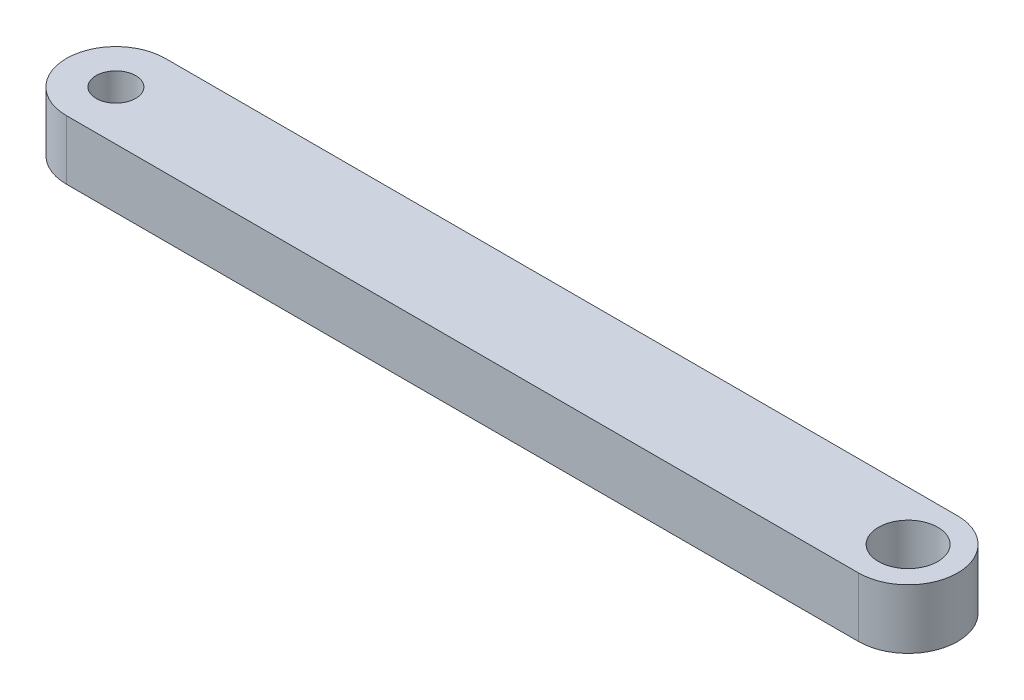
ISO-10303-21;
HEADER;
FILE_DESCRIPTION(('STEP AP214'),'2;1');
FILE_NAME('part.step','',(''),(''),'','','');
FILE_SCHEMA(('AUTOMOTIVE_DESIGN { 1 0 10303 214 1 1 1 1 }'));
ENDSEC;
DATA;
#1=APPLICATION_CONTEXT('core data for automotive mechanical design processes');
#2=APPLICATION_PROTOCOL_DEFINITION('international standard','automotive_design',2000,#1);
#3=PRODUCT_CONTEXT('',#1,'mechanical');
#4=PRODUCT('Part','Part','',(#3));
#5=PRODUCT_RELATED_PRODUCT_CATEGORY('part','',(#4));
#6=PRODUCT_DEFINITION_FORMATION('','',#4);
#7=PRODUCT_DEFINITION_CONTEXT('part definition',#1,'design');
#8=PRODUCT_DEFINITION('design','',#6,#7);
#9=PRODUCT_DEFINITION_SHAPE('','',#8);
#10=(LENGTH_UNIT() NAMED_UNIT(*) SI_UNIT(.MILLI.,.METRE.));
#11=(NAMED_UNIT(*) PLANE_ANGLE_UNIT() SI_UNIT($,.RADIAN.));
#12=(NAMED_UNIT(*) SI_UNIT($,.STERADIAN.) SOLID_ANGLE_UNIT());
#13=UNCERTAINTY_MEASURE_WITH_UNIT(LENGTH_MEASURE(1.E-05),#10,'distance_accuracy_value','');
#14=(GEOMETRIC_REPRESENTATION_CONTEXT(3) GLOBAL_UNCERTAINTY_ASSIGNED_CONTEXT((#13)) GLOBAL_UNIT_ASSIGNED_CONTEXT((#10,
#11,#12)) REPRESENTATION_CONTEXT('',''));
#15=CARTESIAN_POINT('',(0.,0.,0.));
#16=DIRECTION('',(0.,0.,1.));
#17=DIRECTION('',(1.,0.,0.));
#18=AXIS2_PLACEMENT_3D('',#15,#16,#17);
#19=CARTESIAN_POINT('',(31.,3.,0.));
#20=DIRECTION('',(0.,-1.,0.));
#21=DIRECTION('',(0.,0.,-1.));
#22=AXIS2_PLACEMENT_3D('',#19,#20,#21);
#23=CYLINDRICAL_SURFACE('',#22,2.5);
#24=CARTESIAN_POINT('',(31.,0.,0.));
#25=DIRECTION('',(0.,-1.,0.));
#26=DIRECTION('',(0.,0.,-1.));
#27=AXIS2_PLACEMENT_3D('',#24,#25,#26);
#28=CIRCLE('',#27,2.5);
#29=CARTESIAN_POINT('',(31.,0.,-2.5));
#30=VERTEX_POINT('',#29);
#31=CARTESIAN_POINT('',(31.,0.,2.5));
#32=VERTEX_POINT('',#31);
#33=EDGE_CURVE('E97',#30,#32,#28,.T.);
#34=ORIENTED_EDGE('',*,*,#33,.F.);
#35=DIRECTION('',(0.,-1.,0.));
#36=VECTOR('',#35,1.);
#37=CARTESIAN_POINT('',(31.,3.,-2.5));
#38=LINE('',#37,#36);
#39=CARTESIAN_POINT('',(31.,3.,-2.5));
#40=VERTEX_POINT('',#39);
#41=EDGE_CURVE('E11',#40,#30,#38,.T.);
#42=ORIENTED_EDGE('',*,*,#41,.F.);
#43=CARTESIAN_POINT('',(31.,3.,0.));
#44=DIRECTION('',(0.,-1.,0.));
#45=DIRECTION('',(0.,0.,-1.));
#46=AXIS2_PLACEMENT_3D('',#43,#44,#45);
#47=CIRCLE('',#46,2.5);
#48=CARTESIAN_POINT('',(31.,3.,2.5));
#49=VERTEX_POINT('',#48);
#50=EDGE_CURVE('E90',#40,#49,#47,.T.);
#51=ORIENTED_EDGE('',*,*,#50,.T.);
#52=DIRECTION('',(0.,-1.,0.));
#53=VECTOR('',#52,1.);
#54=CARTESIAN_POINT('',(31.,3.,2.5));
#55=LINE('',#54,#53);
#56=EDGE_CURVE('E35',#49,#32,#55,.T.);
#57=ORIENTED_EDGE('',*,*,#56,.T.);
#58=EDGE_LOOP('',(#34,#42,#51,#57));
#59=FACE_BOUND('',#58,.T.);
#60=ADVANCED_FACE('F32',(#59),#23,.T.);
#61=CARTESIAN_POINT('',(-9.00000000000001,3.,-2.5));
#62=DIRECTION('',(0.,0.,-1.));
#63=DIRECTION('',(-1.,0.,0.));
#64=AXIS2_PLACEMENT_3D('',#61,#62,#63);
#65=PLANE('',#64);
#66=DIRECTION('',(1.,0.,0.));
#67=VECTOR('',#66,1.);
#68=CARTESIAN_POINT('',(-9.00000000000001,0.,-2.5));
#69=LINE('',#68,#67);
#70=CARTESIAN_POINT('',(-9.,0.,-2.5));
#71=VERTEX_POINT('',#70);
#72=EDGE_CURVE('E92',#71,#30,#69,.T.);
#73=ORIENTED_EDGE('',*,*,#72,.F.);
#74=DIRECTION('',(0.,-1.,0.));
#75=VECTOR('',#74,1.);
#76=CARTESIAN_POINT('',(-9.,3.,-2.5));
#77=LINE('',#76,#75);
#78=CARTESIAN_POINT('',(-9.,3.,-2.5));
#79=VERTEX_POINT('',#78);
#80=EDGE_CURVE('E41',#79,#71,#77,.T.);
#81=ORIENTED_EDGE('',*,*,#80,.F.);
#82=DIRECTION('',(1.,0.,0.));
#83=VECTOR('',#82,1.);
#84=CARTESIAN_POINT('',(-9.00000000000001,3.,-2.5));
#85=LINE('',#84,#83);
#86=EDGE_CURVE('E87',#79,#40,#85,.T.);
#87=ORIENTED_EDGE('',*,*,#86,.T.);
#88=ORIENTED_EDGE('',*,*,#41,.T.);
#89=EDGE_LOOP('',(#73,#81,#87,#88));
#90=FACE_BOUND('',#89,.T.);
#91=ADVANCED_FACE('F108',(#90),#65,.T.);
#92=CARTESIAN_POINT('',(-9.,3.,0.));
#93=DIRECTION('',(0.,-1.,0.));
#94=DIRECTION('',(0.,0.,-1.));
#95=AXIS2_PLACEMENT_3D('',#92,#93,#94);
#96=CYLINDRICAL_SURFACE('',#95,2.5);
#97=CARTESIAN_POINT('',(-9.,0.,0.));
#98=DIRECTION('',(0.,-1.,0.));
#99=DIRECTION('',(0.,0.,-1.));
#100=AXIS2_PLACEMENT_3D('',#97,#98,#99);
#101=CIRCLE('',#100,2.5);
#102=CARTESIAN_POINT('',(-9.,0.,2.5));
#103=VERTEX_POINT('',#102);
#104=EDGE_CURVE('E82',#103,#71,#101,.T.);
#105=ORIENTED_EDGE('',*,*,#104,.F.);
#106=DIRECTION('',(0.,-1.,0.));
#107=VECTOR('',#106,1.);
#108=CARTESIAN_POINT('',(-9.,3.,2.5));
#109=LINE('',#108,#107);
#110=CARTESIAN_POINT('',(-9.,3.,2.5));
#111=VERTEX_POINT('',#110);
#112=EDGE_CURVE('E77',#111,#103,#109,.T.);
#113=ORIENTED_EDGE('',*,*,#112,.F.);
#114=CARTESIAN_POINT('',(-9.,3.,0.));
#115=DIRECTION('',(0.,-1.,0.));
#116=DIRECTION('',(0.,0.,-1.));
#117=AXIS2_PLACEMENT_3D('',#114,#115,#116);
#118=CIRCLE('',#117,2.5);
#119=EDGE_CURVE('E80',#111,#79,#118,.T.);
#120=ORIENTED_EDGE('',*,*,#119,.T.);
#121=ORIENTED_EDGE('',*,*,#80,.T.);
#122=EDGE_LOOP('',(#105,#113,#120,#121));
#123=FACE_BOUND('',#122,.T.);
#124=ADVANCED_FACE('F79',(#123),#96,.T.);
#125=CARTESIAN_POINT('',(31.,3.,2.5));
#126=DIRECTION('',(0.,0.,1.));
#127=DIRECTION('',(1.,0.,0.));
#128=AXIS2_PLACEMENT_3D('',#125,#126,#127);
#129=PLANE('',#128);
#130=DIRECTION('',(-1.,0.,0.));
#131=VECTOR('',#130,1.);
#132=CARTESIAN_POINT('',(31.,0.,2.5));
#133=LINE('',#132,#131);
#134=EDGE_CURVE('E100',#32,#103,#133,.T.);
#135=ORIENTED_EDGE('',*,*,#134,.F.);
#136=ORIENTED_EDGE('',*,*,#56,.F.);
#137=DIRECTION('',(-1.,0.,0.));
#138=VECTOR('',#137,1.);
#139=CARTESIAN_POINT('',(31.,3.,2.5));
#140=LINE('',#139,#138);
#141=EDGE_CURVE('E86',#49,#111,#140,.T.);
#142=ORIENTED_EDGE('',*,*,#141,.T.);
#143=ORIENTED_EDGE('',*,*,#112,.T.);
#144=EDGE_LOOP('',(#135,#136,#142,#143));
#145=FACE_BOUND('',#144,.T.);
#146=ADVANCED_FACE('F89',(#145),#129,.T.);
#147=CARTESIAN_POINT('',(31.,3.,0.));
#148=DIRECTION('',(0.,-1.,0.));
#149=DIRECTION('',(0.,0.,-1.));
#150=AXIS2_PLACEMENT_3D('',#147,#148,#149);
#151=PLANE('',#150);
#152=CARTESIAN_POINT('',(-9.,3.,0.));
#153=DIRECTION('',(0.,-1.,0.));
#154=DIRECTION('',(0.,0.,1.));
#155=AXIS2_PLACEMENT_3D('',#152,#153,#154);
#156=CIRCLE('',#155,1.);
#157=CARTESIAN_POINT('',(-9.,3.,1.));
#158=VERTEX_POINT('',#157);
#159=EDGE_CURVE('E141',#158,#158,#156,.T.);
#160=ORIENTED_EDGE('',*,*,#159,.T.);
#161=EDGE_LOOP('',(#160));
#162=FACE_BOUND('',#161,.T.);
#163=CARTESIAN_POINT('',(31.,3.,0.));
#164=DIRECTION('',(0.,-1.,0.));
#165=DIRECTION('',(0.,0.,1.));
#166=AXIS2_PLACEMENT_3D('',#163,#164,#165);
#167=CIRCLE('',#166,1.49999999999998);
#168=CARTESIAN_POINT('',(31.,3.,1.49999999999998));
#169=VERTEX_POINT('',#168);
#170=EDGE_CURVE('E101',#169,#169,#167,.T.);
#171=ORIENTED_EDGE('',*,*,#170,.T.);
#172=EDGE_LOOP('',(#171));
#173=FACE_BOUND('',#172,.T.);
#174=ORIENTED_EDGE('',*,*,#50,.F.);
#175=ORIENTED_EDGE('',*,*,#86,.F.);
#176=ORIENTED_EDGE('',*,*,#119,.F.);
#177=ORIENTED_EDGE('',*,*,#141,.F.);
#178=EDGE_LOOP('',(#174,#175,#176,#177));
#179=FACE_BOUND('',#178,.T.);
#180=ADVANCED_FACE('F85',(#162,#173,#179),#151,.F.);
#181=CARTESIAN_POINT('',(31.,0.,0.));
#182=DIRECTION('',(0.,-1.,0.));
#183=DIRECTION('',(0.,0.,-1.));
#184=AXIS2_PLACEMENT_3D('',#181,#182,#183);
#185=PLANE('',#184);
#186=CARTESIAN_POINT('',(-9.,0.,0.));
#187=DIRECTION('',(0.,-1.,0.));
#188=DIRECTION('',(0.,0.,1.));
#189=AXIS2_PLACEMENT_3D('',#186,#187,#188);
#190=CIRCLE('',#189,1.);
#191=CARTESIAN_POINT('',(-9.,0.,1.));
#192=VERTEX_POINT('',#191);
#193=EDGE_CURVE('E144',#192,#192,#190,.T.);
#194=ORIENTED_EDGE('',*,*,#193,.F.);
#195=EDGE_LOOP('',(#194));
#196=FACE_BOUND('',#195,.T.);
#197=CARTESIAN_POINT('',(31.,0.,0.));
#198=DIRECTION('',(0.,-1.,0.));
#199=DIRECTION('',(0.,0.,1.));
#200=AXIS2_PLACEMENT_3D('',#197,#198,#199);
#201=CIRCLE('',#200,1.49999999999998);
#202=CARTESIAN_POINT('',(31.,0.,1.49999999999998));
#203=VERTEX_POINT('',#202);
#204=EDGE_CURVE('E146',#203,#203,#201,.T.);
#205=ORIENTED_EDGE('',*,*,#204,.F.);
#206=EDGE_LOOP('',(#205));
#207=FACE_BOUND('',#206,.T.);
#208=ORIENTED_EDGE('',*,*,#33,.T.);
#209=ORIENTED_EDGE('',*,*,#134,.T.);
#210=ORIENTED_EDGE('',*,*,#104,.T.);
#211=ORIENTED_EDGE('',*,*,#72,.T.);
#212=EDGE_LOOP('',(#208,#209,#210,#211));
#213=FACE_BOUND('',#212,.T.);
#214=ADVANCED_FACE('F107',(#196,#207,#213),#185,.T.);
#215=CARTESIAN_POINT('',(31.,3.,0.));
#216=DIRECTION('',(0.,-1.,0.));
#217=DIRECTION('',(0.,0.,-1.));
#218=AXIS2_PLACEMENT_3D('',#215,#216,#217);
#219=CYLINDRICAL_SURFACE('',#218,1.49999999999998);
#220=ORIENTED_EDGE('',*,*,#170,.F.);
#221=EDGE_LOOP('',(#220));
#222=FACE_BOUND('',#221,.T.);
#223=ORIENTED_EDGE('',*,*,#204,.T.);
#224=EDGE_LOOP('',(#223));
#225=FACE_BOUND('',#224,.T.);
#226=ADVANCED_FACE('F126',(#222,#225),#219,.F.);
#227=CARTESIAN_POINT('',(-9.,3.,0.));
#228=DIRECTION('',(0.,-1.,0.));
#229=DIRECTION('',(0.,0.,-1.));
#230=AXIS2_PLACEMENT_3D('',#227,#228,#229);
#231=CYLINDRICAL_SURFACE('',#230,1.);
#232=ORIENTED_EDGE('',*,*,#159,.F.);
#233=EDGE_LOOP('',(#232));
#234=FACE_BOUND('',#233,.T.);
#235=ORIENTED_EDGE('',*,*,#193,.T.);
#236=EDGE_LOOP('',(#235));
#237=FACE_BOUND('',#236,.T.);
#238=ADVANCED_FACE('F133',(#234,#237),#231,.F.);
#239=CLOSED_SHELL('',(#60,#91,#124,#146,#180,#214,#226,#238));
#240=MANIFOLD_SOLID_BREP('B2',#239);
#241=ADVANCED_BREP_SHAPE_REPRESENTATION('',(#18,#240),#14);
#242=SHAPE_DEFINITION_REPRESENTATION(#9,#241);
ENDSEC;
END-ISO-10303-21;
